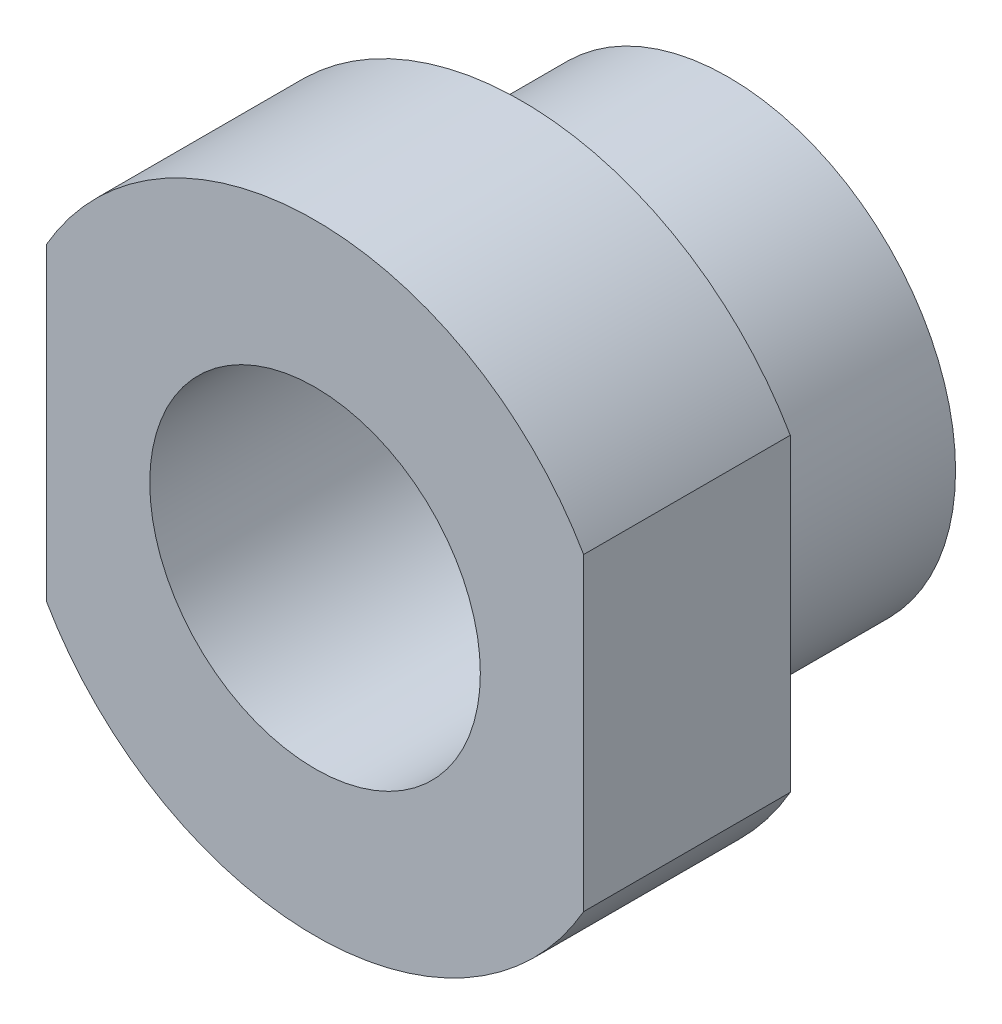
ISO-10303-21;
HEADER;
FILE_DESCRIPTION(('STEP AP214'),'2;1');
FILE_NAME('part.step','',(''),(''),'','','');
FILE_SCHEMA(('AUTOMOTIVE_DESIGN { 1 0 10303 214 1 1 1 1 }'));
ENDSEC;
DATA;
#1=APPLICATION_CONTEXT('core data for automotive mechanical design processes');
#2=APPLICATION_PROTOCOL_DEFINITION('international standard','automotive_design',2000,#1);
#3=PRODUCT_CONTEXT('',#1,'mechanical');
#4=PRODUCT('Part','Part','',(#3));
#5=PRODUCT_RELATED_PRODUCT_CATEGORY('part','',(#4));
#6=PRODUCT_DEFINITION_FORMATION('','',#4);
#7=PRODUCT_DEFINITION_CONTEXT('part definition',#1,'design');
#8=PRODUCT_DEFINITION('design','',#6,#7);
#9=PRODUCT_DEFINITION_SHAPE('','',#8);
#10=(LENGTH_UNIT() NAMED_UNIT(*) SI_UNIT(.MILLI.,.METRE.));
#11=(NAMED_UNIT(*) PLANE_ANGLE_UNIT() SI_UNIT($,.RADIAN.));
#12=(NAMED_UNIT(*) SI_UNIT($,.STERADIAN.) SOLID_ANGLE_UNIT());
#13=UNCERTAINTY_MEASURE_WITH_UNIT(LENGTH_MEASURE(1.E-05),#10,'distance_accuracy_value','');
#14=(GEOMETRIC_REPRESENTATION_CONTEXT(3) GLOBAL_UNCERTAINTY_ASSIGNED_CONTEXT((#13)) GLOBAL_UNIT_ASSIGNED_CONTEXT((#10,
#11,#12)) REPRESENTATION_CONTEXT('',''));
#15=CARTESIAN_POINT('',(0.,0.,0.));
#16=DIRECTION('',(0.,0.,1.));
#17=DIRECTION('',(1.,0.,0.));
#18=AXIS2_PLACEMENT_3D('',#15,#16,#17);
#19=CARTESIAN_POINT('',(0.,0.,0.));
#20=DIRECTION('',(0.,0.,1.));
#21=DIRECTION('',(1.,0.,0.));
#22=AXIS2_PLACEMENT_3D('',#19,#20,#21);
#23=PLANE('',#22);
#24=CARTESIAN_POINT('',(0.,0.,0.));
#25=DIRECTION('',(0.,0.,1.));
#26=DIRECTION('',(1.,0.,0.));
#27=AXIS2_PLACEMENT_3D('',#24,#25,#26);
#28=CIRCLE('',#27,7.5);
#29=CARTESIAN_POINT('',(6.5,3.74165738677395,0.));
#30=VERTEX_POINT('',#29);
#31=CARTESIAN_POINT('',(-6.5,3.74165738677395,0.));
#32=VERTEX_POINT('',#31);
#33=EDGE_CURVE('E101',#30,#32,#28,.T.);
#34=ORIENTED_EDGE('',*,*,#33,.F.);
#35=DIRECTION('',(0.,1.,0.));
#36=VECTOR('',#35,1.);
#37=CARTESIAN_POINT('',(6.5,3.74165738677395,0.));
#38=LINE('',#37,#36);
#39=CARTESIAN_POINT('',(6.5,-3.74165738677395,0.));
#40=VERTEX_POINT('',#39);
#41=EDGE_CURVE('E73',#40,#30,#38,.T.);
#42=ORIENTED_EDGE('',*,*,#41,.F.);
#43=CARTESIAN_POINT('',(0.,0.,0.));
#44=DIRECTION('',(0.,0.,1.));
#45=DIRECTION('',(1.,0.,0.));
#46=AXIS2_PLACEMENT_3D('',#43,#44,#45);
#47=CIRCLE('',#46,7.5);
#48=CARTESIAN_POINT('',(-6.5,-3.74165738677395,0.));
#49=VERTEX_POINT('',#48);
#50=EDGE_CURVE('E67',#49,#40,#47,.T.);
#51=ORIENTED_EDGE('',*,*,#50,.F.);
#52=DIRECTION('',(0.,-1.,0.));
#53=VECTOR('',#52,1.);
#54=CARTESIAN_POINT('',(-6.5,3.74165738677395,0.));
#55=LINE('',#54,#53);
#56=EDGE_CURVE('E92',#32,#49,#55,.T.);
#57=ORIENTED_EDGE('',*,*,#56,.F.);
#58=EDGE_LOOP('',(#34,#42,#51,#57));
#59=FACE_BOUND('',#58,.T.);
#60=CARTESIAN_POINT('',(0.,0.,0.));
#61=DIRECTION('',(0.,0.,1.));
#62=DIRECTION('',(1.,0.,0.));
#63=AXIS2_PLACEMENT_3D('',#60,#61,#62);
#64=CIRCLE('',#63,5.5);
#65=CARTESIAN_POINT('',(5.5,0.,0.));
#66=VERTEX_POINT('',#65);
#67=EDGE_CURVE('E11',#66,#66,#64,.F.);
#68=ORIENTED_EDGE('',*,*,#67,.F.);
#69=EDGE_LOOP('',(#68));
#70=FACE_BOUND('',#69,.T.);
#71=ADVANCED_FACE('F33',(#59,#70),#23,.F.);
#72=CARTESIAN_POINT('',(0.,0.,5.));
#73=DIRECTION('',(0.,0.,1.));
#74=DIRECTION('',(1.,0.,0.));
#75=AXIS2_PLACEMENT_3D('',#72,#73,#74);
#76=PLANE('',#75);
#77=CARTESIAN_POINT('',(0.,0.,5.));
#78=DIRECTION('',(0.,0.,1.));
#79=DIRECTION('',(1.,0.,0.));
#80=AXIS2_PLACEMENT_3D('',#77,#78,#79);
#81=CIRCLE('',#80,7.5);
#82=CARTESIAN_POINT('',(6.5,3.74165738677395,5.));
#83=VERTEX_POINT('',#82);
#84=CARTESIAN_POINT('',(-6.5,3.74165738677395,5.));
#85=VERTEX_POINT('',#84);
#86=EDGE_CURVE('E87',#83,#85,#81,.T.);
#87=ORIENTED_EDGE('',*,*,#86,.T.);
#88=DIRECTION('',(0.,-1.,0.));
#89=VECTOR('',#88,1.);
#90=CARTESIAN_POINT('',(-6.5,3.74165738677395,5.));
#91=LINE('',#90,#89);
#92=CARTESIAN_POINT('',(-6.5,-3.74165738677395,5.));
#93=VERTEX_POINT('',#92);
#94=EDGE_CURVE('E81',#85,#93,#91,.T.);
#95=ORIENTED_EDGE('',*,*,#94,.T.);
#96=CARTESIAN_POINT('',(0.,0.,5.));
#97=DIRECTION('',(0.,0.,1.));
#98=DIRECTION('',(1.,0.,0.));
#99=AXIS2_PLACEMENT_3D('',#96,#97,#98);
#100=CIRCLE('',#99,7.5);
#101=CARTESIAN_POINT('',(6.5,-3.74165738677395,5.));
#102=VERTEX_POINT('',#101);
#103=EDGE_CURVE('E85',#93,#102,#100,.T.);
#104=ORIENTED_EDGE('',*,*,#103,.T.);
#105=DIRECTION('',(0.,1.,0.));
#106=VECTOR('',#105,1.);
#107=CARTESIAN_POINT('',(6.5,3.74165738677395,5.));
#108=LINE('',#107,#106);
#109=EDGE_CURVE('E50',#102,#83,#108,.T.);
#110=ORIENTED_EDGE('',*,*,#109,.T.);
#111=EDGE_LOOP('',(#87,#95,#104,#110));
#112=FACE_BOUND('',#111,.T.);
#113=CARTESIAN_POINT('',(0.,0.,5.));
#114=DIRECTION('',(0.,0.,1.));
#115=DIRECTION('',(1.,0.,0.));
#116=AXIS2_PLACEMENT_3D('',#113,#114,#115);
#117=CIRCLE('',#116,4.);
#118=CARTESIAN_POINT('',(4.,0.,5.));
#119=VERTEX_POINT('',#118);
#120=EDGE_CURVE('E104',#119,#119,#117,.T.);
#121=ORIENTED_EDGE('',*,*,#120,.F.);
#122=EDGE_LOOP('',(#121));
#123=FACE_BOUND('',#122,.T.);
#124=ADVANCED_FACE('F82',(#112,#123),#76,.T.);
#125=CARTESIAN_POINT('',(0.,0.,5.));
#126=DIRECTION('',(0.,0.,-1.));
#127=DIRECTION('',(-1.,0.,0.));
#128=AXIS2_PLACEMENT_3D('',#125,#126,#127);
#129=CYLINDRICAL_SURFACE('',#128,7.5);
#130=ORIENTED_EDGE('',*,*,#33,.T.);
#131=DIRECTION('',(0.,0.,-1.));
#132=VECTOR('',#131,1.);
#133=CARTESIAN_POINT('',(-6.5,3.74165738677395,5.));
#134=LINE('',#133,#132);
#135=EDGE_CURVE('E42',#85,#32,#134,.T.);
#136=ORIENTED_EDGE('',*,*,#135,.F.);
#137=ORIENTED_EDGE('',*,*,#86,.F.);
#138=DIRECTION('',(0.,0.,-1.));
#139=VECTOR('',#138,1.);
#140=CARTESIAN_POINT('',(6.5,3.74165738677395,5.));
#141=LINE('',#140,#139);
#142=EDGE_CURVE('E97',#83,#30,#141,.T.);
#143=ORIENTED_EDGE('',*,*,#142,.T.);
#144=EDGE_LOOP('',(#130,#136,#137,#143));
#145=FACE_BOUND('',#144,.T.);
#146=ADVANCED_FACE('F35',(#145),#129,.T.);
#147=CARTESIAN_POINT('',(-6.5,3.74165738677395,5.));
#148=DIRECTION('',(1.,0.,0.));
#149=DIRECTION('',(0.,0.,-1.));
#150=AXIS2_PLACEMENT_3D('',#147,#148,#149);
#151=PLANE('',#150);
#152=ORIENTED_EDGE('',*,*,#56,.T.);
#153=DIRECTION('',(0.,0.,-1.));
#154=VECTOR('',#153,1.);
#155=CARTESIAN_POINT('',(-6.5,-3.74165738677395,5.));
#156=LINE('',#155,#154);
#157=EDGE_CURVE('E90',#93,#49,#156,.T.);
#158=ORIENTED_EDGE('',*,*,#157,.F.);
#159=ORIENTED_EDGE('',*,*,#94,.F.);
#160=ORIENTED_EDGE('',*,*,#135,.T.);
#161=EDGE_LOOP('',(#152,#158,#159,#160));
#162=FACE_BOUND('',#161,.T.);
#163=ADVANCED_FACE('F91',(#162),#151,.F.);
#164=CARTESIAN_POINT('',(0.,0.,5.));
#165=DIRECTION('',(0.,0.,-1.));
#166=DIRECTION('',(-1.,0.,0.));
#167=AXIS2_PLACEMENT_3D('',#164,#165,#166);
#168=CYLINDRICAL_SURFACE('',#167,7.5);
#169=ORIENTED_EDGE('',*,*,#50,.T.);
#170=DIRECTION('',(0.,0.,-1.));
#171=VECTOR('',#170,1.);
#172=CARTESIAN_POINT('',(6.5,-3.74165738677395,5.));
#173=LINE('',#172,#171);
#174=EDGE_CURVE('E93',#102,#40,#173,.T.);
#175=ORIENTED_EDGE('',*,*,#174,.F.);
#176=ORIENTED_EDGE('',*,*,#103,.F.);
#177=ORIENTED_EDGE('',*,*,#157,.T.);
#178=EDGE_LOOP('',(#169,#175,#176,#177));
#179=FACE_BOUND('',#178,.T.);
#180=ADVANCED_FACE('F95',(#179),#168,.T.);
#181=CARTESIAN_POINT('',(6.5,3.74165738677395,5.));
#182=DIRECTION('',(-1.,0.,0.));
#183=DIRECTION('',(0.,0.,1.));
#184=AXIS2_PLACEMENT_3D('',#181,#182,#183);
#185=PLANE('',#184);
#186=ORIENTED_EDGE('',*,*,#41,.T.);
#187=ORIENTED_EDGE('',*,*,#142,.F.);
#188=ORIENTED_EDGE('',*,*,#109,.F.);
#189=ORIENTED_EDGE('',*,*,#174,.T.);
#190=EDGE_LOOP('',(#186,#187,#188,#189));
#191=FACE_BOUND('',#190,.T.);
#192=ADVANCED_FACE('F132',(#191),#185,.F.);
#193=CARTESIAN_POINT('',(0.,0.,5.));
#194=DIRECTION('',(0.,0.,-1.));
#195=DIRECTION('',(-1.,0.,0.));
#196=AXIS2_PLACEMENT_3D('',#193,#194,#195);
#197=CYLINDRICAL_SURFACE('',#196,4.);
#198=ORIENTED_EDGE('',*,*,#120,.T.);
#199=EDGE_LOOP('',(#198));
#200=FACE_BOUND('',#199,.T.);
#201=CARTESIAN_POINT('',(0.,0.,-5.));
#202=DIRECTION('',(0.,0.,-1.));
#203=DIRECTION('',(-1.,0.,0.));
#204=AXIS2_PLACEMENT_3D('',#201,#202,#203);
#205=CIRCLE('',#204,4.);
#206=CARTESIAN_POINT('',(-4.,0.,-5.));
#207=VERTEX_POINT('',#206);
#208=EDGE_CURVE('E201',#207,#207,#205,.T.);
#209=ORIENTED_EDGE('',*,*,#208,.T.);
#210=EDGE_LOOP('',(#209));
#211=FACE_BOUND('',#210,.T.);
#212=ADVANCED_FACE('F125',(#200,#211),#197,.F.);
#213=CARTESIAN_POINT('',(0.,0.,-5.));
#214=DIRECTION('',(0.,0.,-1.));
#215=DIRECTION('',(-1.,0.,0.));
#216=AXIS2_PLACEMENT_3D('',#213,#214,#215);
#217=PLANE('',#216);
#218=CARTESIAN_POINT('',(0.,0.,-5.));
#219=DIRECTION('',(0.,0.,-1.));
#220=DIRECTION('',(-1.,0.,0.));
#221=AXIS2_PLACEMENT_3D('',#218,#219,#220);
#222=CIRCLE('',#221,5.5);
#223=CARTESIAN_POINT('',(-5.5,0.,-5.));
#224=VERTEX_POINT('',#223);
#225=EDGE_CURVE('E203',#224,#224,#222,.T.);
#226=ORIENTED_EDGE('',*,*,#225,.T.);
#227=EDGE_LOOP('',(#226));
#228=FACE_BOUND('',#227,.T.);
#229=ORIENTED_EDGE('',*,*,#208,.F.);
#230=EDGE_LOOP('',(#229));
#231=FACE_BOUND('',#230,.T.);
#232=ADVANCED_FACE('F119',(#228,#231),#217,.T.);
#233=CARTESIAN_POINT('',(0.,0.,-5.));
#234=DIRECTION('',(0.,0.,1.));
#235=DIRECTION('',(1.,0.,0.));
#236=AXIS2_PLACEMENT_3D('',#233,#234,#235);
#237=CYLINDRICAL_SURFACE('',#236,5.5);
#238=ORIENTED_EDGE('',*,*,#225,.F.);
#239=EDGE_LOOP('',(#238));
#240=FACE_BOUND('',#239,.T.);
#241=ORIENTED_EDGE('',*,*,#67,.T.);
#242=EDGE_LOOP('',(#241));
#243=FACE_BOUND('',#242,.T.);
#244=ADVANCED_FACE('F117',(#240,#243),#237,.T.);
#245=CLOSED_SHELL('',(#71,#124,#146,#163,#180,#192,#212,#232,#244));
#246=MANIFOLD_SOLID_BREP('B2',#245);
#247=ADVANCED_BREP_SHAPE_REPRESENTATION('',(#18,#246),#14);
#248=SHAPE_DEFINITION_REPRESENTATION(#9,#247);
ENDSEC;
END-ISO-10303-21;
